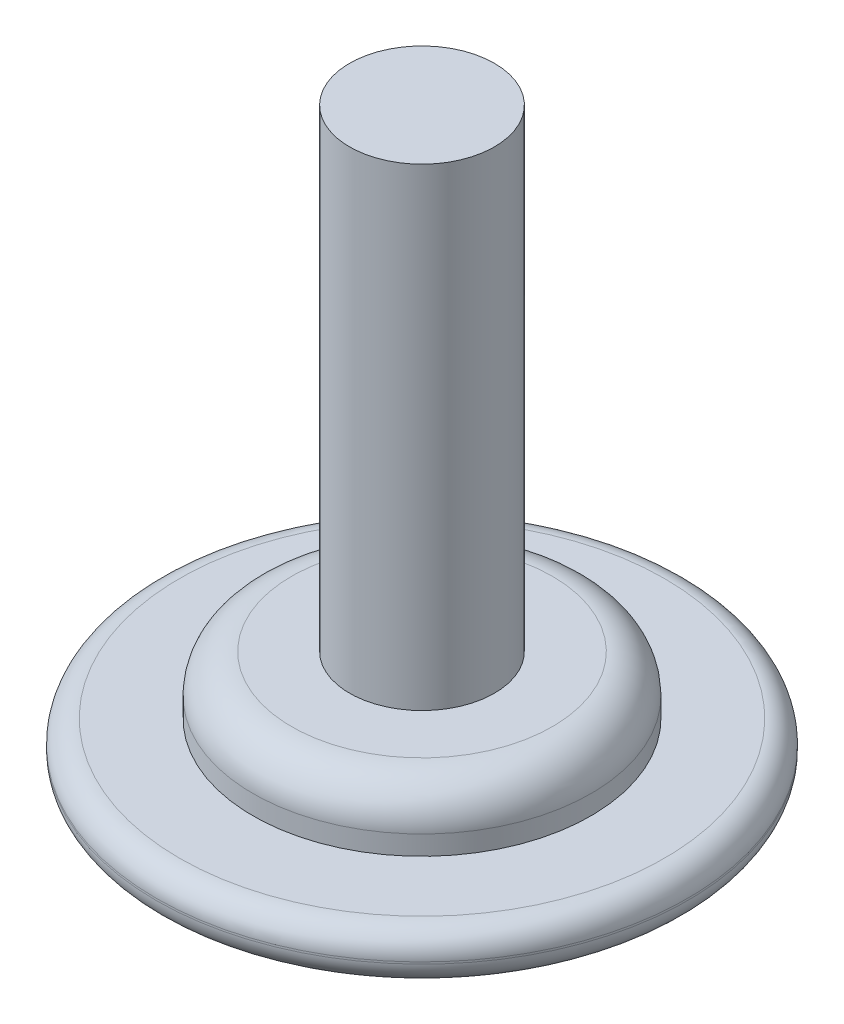
ISO-10303-21;
HEADER;
FILE_DESCRIPTION(('STEP AP214'),'2;1');
FILE_NAME('part.step','',(''),(''),'','','');
FILE_SCHEMA(('AUTOMOTIVE_DESIGN { 1 0 10303 214 1 1 1 1 }'));
ENDSEC;
DATA;
#1=APPLICATION_CONTEXT('core data for automotive mechanical design processes');
#2=APPLICATION_PROTOCOL_DEFINITION('international standard','automotive_design',2000,#1);
#3=PRODUCT_CONTEXT('',#1,'mechanical');
#4=PRODUCT('Part','Part','',(#3));
#5=PRODUCT_RELATED_PRODUCT_CATEGORY('part','',(#4));
#6=PRODUCT_DEFINITION_FORMATION('','',#4);
#7=PRODUCT_DEFINITION_CONTEXT('part definition',#1,'design');
#8=PRODUCT_DEFINITION('design','',#6,#7);
#9=PRODUCT_DEFINITION_SHAPE('','',#8);
#10=(LENGTH_UNIT() NAMED_UNIT(*) SI_UNIT(.MILLI.,.METRE.));
#11=(NAMED_UNIT(*) PLANE_ANGLE_UNIT() SI_UNIT($,.RADIAN.));
#12=(NAMED_UNIT(*) SI_UNIT($,.STERADIAN.) SOLID_ANGLE_UNIT());
#13=UNCERTAINTY_MEASURE_WITH_UNIT(LENGTH_MEASURE(1.E-05),#10,'distance_accuracy_value','');
#14=(GEOMETRIC_REPRESENTATION_CONTEXT(3) GLOBAL_UNCERTAINTY_ASSIGNED_CONTEXT((#13)) GLOBAL_UNIT_ASSIGNED_CONTEXT((#10,
#11,#12)) REPRESENTATION_CONTEXT('',''));
#15=CARTESIAN_POINT('',(0.,0.,0.));
#16=DIRECTION('',(0.,0.,1.));
#17=DIRECTION('',(1.,0.,0.));
#18=AXIS2_PLACEMENT_3D('',#15,#16,#17);
#19=CARTESIAN_POINT('',(-17.4625,0.,0.));
#20=DIRECTION('',(0.,1.,0.));
#21=DIRECTION('',(0.,0.,1.));
#22=AXIS2_PLACEMENT_3D('',#19,#20,#21);
#23=PLANE('',#22);
#24=CARTESIAN_POINT('',(0.,0.,0.));
#25=DIRECTION('',(0.,1.,0.));
#26=DIRECTION('',(0.,0.,1.));
#27=AXIS2_PLACEMENT_3D('',#24,#25,#26);
#28=CIRCLE('',#27,15.9385);
#29=CARTESIAN_POINT('',(0.,0.,15.9385));
#30=VERTEX_POINT('',#29);
#31=EDGE_CURVE('E47',#30,#30,#28,.F.);
#32=ORIENTED_EDGE('',*,*,#31,.T.);
#33=EDGE_LOOP('',(#32));
#34=FACE_BOUND('',#33,.T.);
#35=ADVANCED_FACE('F37',(#34),#23,.F.);
#36=CARTESIAN_POINT('',(0.,38.1,0.));
#37=DIRECTION('',(0.,-1.,0.));
#38=DIRECTION('',(0.,0.,-1.));
#39=AXIS2_PLACEMENT_3D('',#36,#37,#38);
#40=PLANE('',#39);
#41=CARTESIAN_POINT('',(0.,38.1,0.));
#42=DIRECTION('',(0.,-1.,0.));
#43=DIRECTION('',(0.,0.,-1.));
#44=AXIS2_PLACEMENT_3D('',#41,#42,#43);
#45=CIRCLE('',#44,4.7625);
#46=CARTESIAN_POINT('',(0.,38.1,-4.7625));
#47=VERTEX_POINT('',#46);
#48=EDGE_CURVE('E62',#47,#47,#45,.T.);
#49=ORIENTED_EDGE('',*,*,#48,.F.);
#50=EDGE_LOOP('',(#49));
#51=FACE_BOUND('',#50,.T.);
#52=ADVANCED_FACE('F88',(#51),#40,.F.);
#53=CARTESIAN_POINT('',(0.,0.,0.));
#54=DIRECTION('',(0.,-1.,0.));
#55=DIRECTION('',(0.,0.,-1.));
#56=AXIS2_PLACEMENT_3D('',#53,#54,#55);
#57=CYLINDRICAL_SURFACE('',#56,4.7625);
#58=CARTESIAN_POINT('',(0.,6.985,0.));
#59=DIRECTION('',(0.,-1.,0.));
#60=DIRECTION('',(0.,0.,-1.));
#61=AXIS2_PLACEMENT_3D('',#58,#59,#60);
#62=CIRCLE('',#61,4.7625);
#63=CARTESIAN_POINT('',(0.,6.985,-4.7625));
#64=VERTEX_POINT('',#63);
#65=EDGE_CURVE('E65',#64,#64,#62,.T.);
#66=ORIENTED_EDGE('',*,*,#65,.F.);
#67=EDGE_LOOP('',(#66));
#68=FACE_BOUND('',#67,.T.);
#69=ORIENTED_EDGE('',*,*,#48,.T.);
#70=EDGE_LOOP('',(#69));
#71=FACE_BOUND('',#70,.T.);
#72=ADVANCED_FACE('F85',(#68,#71),#57,.T.);
#73=CARTESIAN_POINT('',(-4.7625,6.985,0.));
#74=DIRECTION('',(0.,-1.,0.));
#75=DIRECTION('',(0.,0.,-1.));
#76=AXIS2_PLACEMENT_3D('',#73,#74,#75);
#77=PLANE('',#76);
#78=CARTESIAN_POINT('',(0.,6.985,0.));
#79=DIRECTION('',(0.,-1.,0.));
#80=DIRECTION('',(0.,0.,-1.));
#81=AXIS2_PLACEMENT_3D('',#78,#79,#80);
#82=CIRCLE('',#81,8.5725);
#83=CARTESIAN_POINT('',(0.,6.985,-8.5725));
#84=VERTEX_POINT('',#83);
#85=EDGE_CURVE('E10',#84,#84,#82,.F.);
#86=ORIENTED_EDGE('',*,*,#85,.T.);
#87=EDGE_LOOP('',(#86));
#88=FACE_BOUND('',#87,.T.);
#89=ORIENTED_EDGE('',*,*,#65,.T.);
#90=EDGE_LOOP('',(#89));
#91=FACE_BOUND('',#90,.T.);
#92=ADVANCED_FACE('F76',(#88,#91),#77,.F.);
#93=CARTESIAN_POINT('',(0.,0.,0.));
#94=DIRECTION('',(0.,-1.,0.));
#95=DIRECTION('',(0.,0.,-1.));
#96=AXIS2_PLACEMENT_3D('',#93,#94,#95);
#97=CYLINDRICAL_SURFACE('',#96,11.1125);
#98=CARTESIAN_POINT('',(0.,4.445,0.));
#99=DIRECTION('',(0.,-1.,0.));
#100=DIRECTION('',(0.,0.,-1.));
#101=AXIS2_PLACEMENT_3D('',#98,#99,#100);
#102=CIRCLE('',#101,11.1125);
#103=CARTESIAN_POINT('',(0.,4.445,-11.1125));
#104=VERTEX_POINT('',#103);
#105=EDGE_CURVE('E43',#104,#104,#102,.T.);
#106=ORIENTED_EDGE('',*,*,#105,.T.);
#107=EDGE_LOOP('',(#106));
#108=FACE_BOUND('',#107,.T.);
#109=CARTESIAN_POINT('',(0.,3.175,0.));
#110=DIRECTION('',(0.,-1.,0.));
#111=DIRECTION('',(0.,0.,-1.));
#112=AXIS2_PLACEMENT_3D('',#109,#110,#111);
#113=CIRCLE('',#112,11.1125);
#114=CARTESIAN_POINT('',(0.,3.175,-11.1125));
#115=VERTEX_POINT('',#114);
#116=EDGE_CURVE('E68',#115,#115,#113,.T.);
#117=ORIENTED_EDGE('',*,*,#116,.F.);
#118=EDGE_LOOP('',(#117));
#119=FACE_BOUND('',#118,.T.);
#120=ADVANCED_FACE('F74',(#108,#119),#97,.T.);
#121=CARTESIAN_POINT('',(-11.1125,3.175,0.));
#122=DIRECTION('',(0.,-1.,0.));
#123=DIRECTION('',(0.,0.,-1.));
#124=AXIS2_PLACEMENT_3D('',#121,#122,#123);
#125=PLANE('',#124);
#126=CARTESIAN_POINT('',(0.,3.175,0.));
#127=DIRECTION('',(0.,-1.,0.));
#128=DIRECTION('',(0.,0.,-1.));
#129=AXIS2_PLACEMENT_3D('',#126,#127,#128);
#130=CIRCLE('',#129,15.9385);
#131=CARTESIAN_POINT('',(0.,3.175,-15.9385));
#132=VERTEX_POINT('',#131);
#133=EDGE_CURVE('E51',#132,#132,#130,.F.);
#134=ORIENTED_EDGE('',*,*,#133,.T.);
#135=EDGE_LOOP('',(#134));
#136=FACE_BOUND('',#135,.T.);
#137=ORIENTED_EDGE('',*,*,#116,.T.);
#138=EDGE_LOOP('',(#137));
#139=FACE_BOUND('',#138,.T.);
#140=ADVANCED_FACE('F72',(#136,#139),#125,.F.);
#141=CARTESIAN_POINT('',(0.,0.,0.));
#142=DIRECTION('',(0.,-1.,0.));
#143=DIRECTION('',(0.,0.,-1.));
#144=AXIS2_PLACEMENT_3D('',#141,#142,#143);
#145=CYLINDRICAL_SURFACE('',#144,17.4625);
#146=CARTESIAN_POINT('',(0.,1.651,0.));
#147=DIRECTION('',(0.,-1.,0.));
#148=DIRECTION('',(0.,0.,-1.));
#149=AXIS2_PLACEMENT_3D('',#146,#147,#148);
#150=CIRCLE('',#149,17.4625);
#151=CARTESIAN_POINT('',(0.,1.651,-17.4625));
#152=VERTEX_POINT('',#151);
#153=EDGE_CURVE('E56',#152,#152,#150,.T.);
#154=ORIENTED_EDGE('',*,*,#153,.T.);
#155=EDGE_LOOP('',(#154));
#156=FACE_BOUND('',#155,.T.);
#157=CARTESIAN_POINT('',(0.,1.524,0.));
#158=DIRECTION('',(0.,1.,0.));
#159=DIRECTION('',(0.,0.,1.));
#160=AXIS2_PLACEMENT_3D('',#157,#158,#159);
#161=CIRCLE('',#160,17.4625);
#162=CARTESIAN_POINT('',(0.,1.524,17.4625));
#163=VERTEX_POINT('',#162);
#164=EDGE_CURVE('E59',#163,#163,#161,.T.);
#165=ORIENTED_EDGE('',*,*,#164,.T.);
#166=EDGE_LOOP('',(#165));
#167=FACE_BOUND('',#166,.T.);
#168=ADVANCED_FACE('F82',(#156,#167),#145,.T.);
#169=CARTESIAN_POINT('',(0.,1.651,0.));
#170=DIRECTION('',(0.,-1.,0.));
#171=DIRECTION('',(0.,0.,-1.));
#172=AXIS2_PLACEMENT_3D('',#169,#170,#171);
#173=TOROIDAL_SURFACE('',#172,15.9385,1.524);
#174=ORIENTED_EDGE('',*,*,#133,.F.);
#175=EDGE_LOOP('',(#174));
#176=FACE_BOUND('',#175,.T.);
#177=ORIENTED_EDGE('',*,*,#153,.F.);
#178=EDGE_LOOP('',(#177));
#179=FACE_BOUND('',#178,.T.);
#180=ADVANCED_FACE('F99',(#176,#179),#173,.T.);
#181=CARTESIAN_POINT('',(0.,1.524,0.));
#182=DIRECTION('',(0.,1.,0.));
#183=DIRECTION('',(0.,0.,1.));
#184=AXIS2_PLACEMENT_3D('',#181,#182,#183);
#185=TOROIDAL_SURFACE('',#184,15.9385,1.524);
#186=ORIENTED_EDGE('',*,*,#164,.F.);
#187=EDGE_LOOP('',(#186));
#188=FACE_BOUND('',#187,.T.);
#189=ORIENTED_EDGE('',*,*,#31,.F.);
#190=EDGE_LOOP('',(#189));
#191=FACE_BOUND('',#190,.T.);
#192=ADVANCED_FACE('F96',(#188,#191),#185,.T.);
#193=CARTESIAN_POINT('',(0.,4.445,0.));
#194=DIRECTION('',(0.,-1.,0.));
#195=DIRECTION('',(0.,0.,-1.));
#196=AXIS2_PLACEMENT_3D('',#193,#194,#195);
#197=TOROIDAL_SURFACE('',#196,8.5725,2.54);
#198=ORIENTED_EDGE('',*,*,#85,.F.);
#199=EDGE_LOOP('',(#198));
#200=FACE_BOUND('',#199,.T.);
#201=ORIENTED_EDGE('',*,*,#105,.F.);
#202=EDGE_LOOP('',(#201));
#203=FACE_BOUND('',#202,.T.);
#204=ADVANCED_FACE('F98',(#200,#203),#197,.T.);
#205=CLOSED_SHELL('',(#35,#52,#72,#92,#120,#140,#168,#180,#192,#204));
#206=MANIFOLD_SOLID_BREP('B2',#205);
#207=ADVANCED_BREP_SHAPE_REPRESENTATION('',(#18,#206),#14);
#208=SHAPE_DEFINITION_REPRESENTATION(#9,#207);
ENDSEC;
END-ISO-10303-21;
